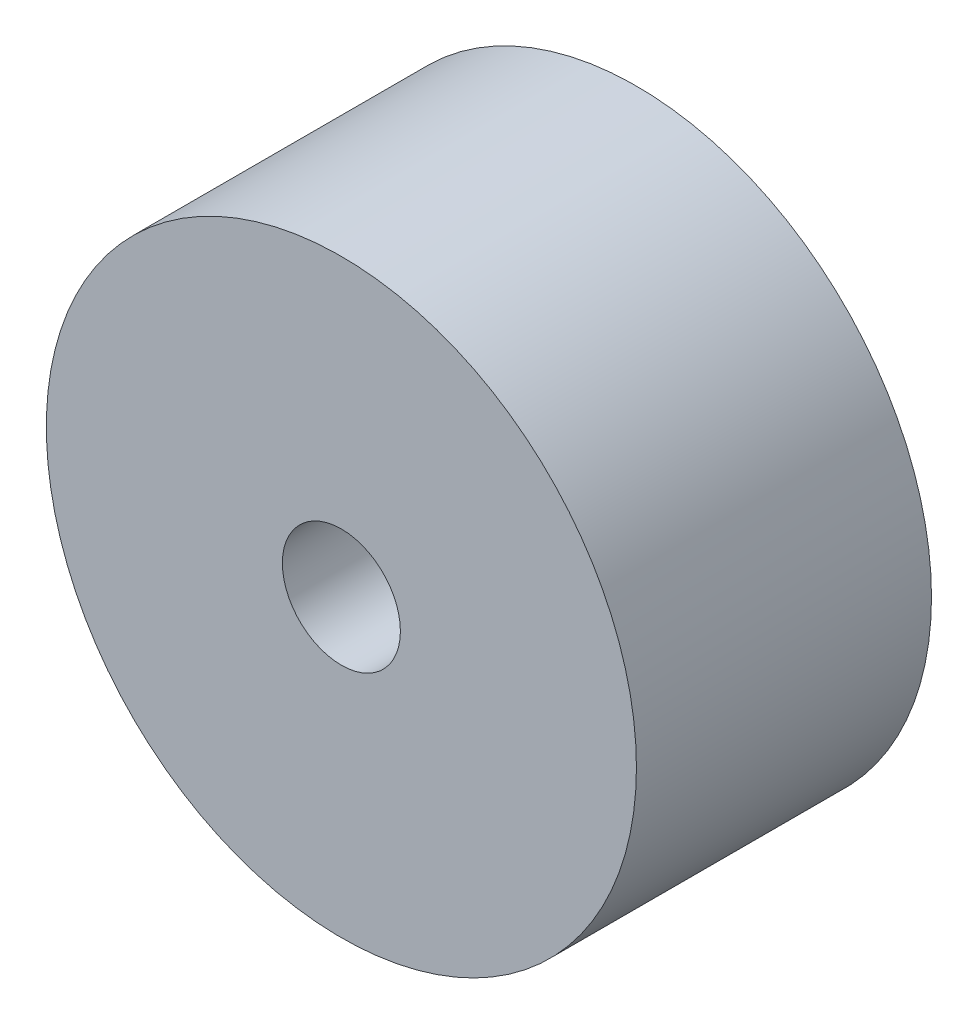
ISO-10303-21;
HEADER;
FILE_DESCRIPTION(('STEP AP214'),'2;1');
FILE_NAME('part.step','',(''),(''),'','','');
FILE_SCHEMA(('AUTOMOTIVE_DESIGN { 1 0 10303 214 1 1 1 1 }'));
ENDSEC;
DATA;
#1=APPLICATION_CONTEXT('core data for automotive mechanical design processes');
#2=APPLICATION_PROTOCOL_DEFINITION('international standard','automotive_design',2000,#1);
#3=PRODUCT_CONTEXT('',#1,'mechanical');
#4=PRODUCT('Part','Part','',(#3));
#5=PRODUCT_RELATED_PRODUCT_CATEGORY('part','',(#4));
#6=PRODUCT_DEFINITION_FORMATION('','',#4);
#7=PRODUCT_DEFINITION_CONTEXT('part definition',#1,'design');
#8=PRODUCT_DEFINITION('design','',#6,#7);
#9=PRODUCT_DEFINITION_SHAPE('','',#8);
#10=(LENGTH_UNIT() NAMED_UNIT(*) SI_UNIT(.MILLI.,.METRE.));
#11=(NAMED_UNIT(*) PLANE_ANGLE_UNIT() SI_UNIT($,.RADIAN.));
#12=(NAMED_UNIT(*) SI_UNIT($,.STERADIAN.) SOLID_ANGLE_UNIT());
#13=UNCERTAINTY_MEASURE_WITH_UNIT(LENGTH_MEASURE(1.E-05),#10,'distance_accuracy_value','');
#14=(GEOMETRIC_REPRESENTATION_CONTEXT(3) GLOBAL_UNCERTAINTY_ASSIGNED_CONTEXT((#13)) GLOBAL_UNIT_ASSIGNED_CONTEXT((#10,
#11,#12)) REPRESENTATION_CONTEXT('',''));
#15=CARTESIAN_POINT('',(0.,0.,0.));
#16=DIRECTION('',(0.,0.,1.));
#17=DIRECTION('',(1.,0.,0.));
#18=AXIS2_PLACEMENT_3D('',#15,#16,#17);
#19=CARTESIAN_POINT('',(0.,0.,0.));
#20=DIRECTION('',(0.,0.,1.));
#21=DIRECTION('',(1.,0.,0.));
#22=AXIS2_PLACEMENT_3D('',#19,#20,#21);
#23=PLANE('',#22);
#24=CARTESIAN_POINT('',(0.,0.,0.));
#25=DIRECTION('',(0.,0.,1.));
#26=DIRECTION('',(1.,0.,0.));
#27=AXIS2_PLACEMENT_3D('',#24,#25,#26);
#28=CIRCLE('',#27,0.5);
#29=CARTESIAN_POINT('',(0.5,0.,0.));
#30=VERTEX_POINT('',#29);
#31=EDGE_CURVE('E49',#30,#30,#28,.T.);
#32=ORIENTED_EDGE('',*,*,#31,.F.);
#33=EDGE_LOOP('',(#32));
#34=FACE_BOUND('',#33,.T.);
#35=CARTESIAN_POINT('',(0.,0.,0.));
#36=DIRECTION('',(0.,0.,-1.));
#37=DIRECTION('',(-1.,0.,0.));
#38=AXIS2_PLACEMENT_3D('',#35,#36,#37);
#39=CIRCLE('',#38,0.279508497187474);
#40=CARTESIAN_POINT('',(-0.279508497187474,0.,0.));
#41=VERTEX_POINT('',#40);
#42=EDGE_CURVE('E57',#41,#41,#39,.T.);
#43=ORIENTED_EDGE('',*,*,#42,.F.);
#44=EDGE_LOOP('',(#43));
#45=FACE_BOUND('',#44,.T.);
#46=ADVANCED_FACE('F34',(#34,#45),#23,.F.);
#47=CARTESIAN_POINT('',(0.,0.,0.5));
#48=DIRECTION('',(0.,0.,-1.));
#49=DIRECTION('',(-1.,0.,0.));
#50=AXIS2_PLACEMENT_3D('',#47,#48,#49);
#51=CYLINDRICAL_SURFACE('',#50,0.1);
#52=CARTESIAN_POINT('',(0.,0.,0.211654632815485));
#53=DIRECTION('',(0.,0.,-1.));
#54=DIRECTION('',(-1.,0.,0.));
#55=AXIS2_PLACEMENT_3D('',#52,#53,#54);
#56=CIRCLE('',#55,0.1);
#57=CARTESIAN_POINT('',(-0.1,0.,0.211654632815485));
#58=VERTEX_POINT('',#57);
#59=EDGE_CURVE('E41',#58,#58,#56,.T.);
#60=ORIENTED_EDGE('',*,*,#59,.T.);
#61=EDGE_LOOP('',(#60));
#62=FACE_BOUND('',#61,.T.);
#63=CARTESIAN_POINT('',(0.,0.,0.5));
#64=DIRECTION('',(0.,0.,1.));
#65=DIRECTION('',(1.,0.,0.));
#66=AXIS2_PLACEMENT_3D('',#63,#64,#65);
#67=CIRCLE('',#66,0.1);
#68=CARTESIAN_POINT('',(0.1,0.,0.5));
#69=VERTEX_POINT('',#68);
#70=EDGE_CURVE('E53',#69,#69,#67,.T.);
#71=ORIENTED_EDGE('',*,*,#70,.T.);
#72=EDGE_LOOP('',(#71));
#73=FACE_BOUND('',#72,.T.);
#74=ADVANCED_FACE('F64',(#62,#73),#51,.F.);
#75=CARTESIAN_POINT('',(0.,0.,0.5));
#76=DIRECTION('',(0.,0.,1.));
#77=DIRECTION('',(1.,0.,0.));
#78=AXIS2_PLACEMENT_3D('',#75,#76,#77);
#79=PLANE('',#78);
#80=CARTESIAN_POINT('',(0.,0.,0.5));
#81=DIRECTION('',(0.,0.,1.));
#82=DIRECTION('',(1.,0.,0.));
#83=AXIS2_PLACEMENT_3D('',#80,#81,#82);
#84=CIRCLE('',#83,0.5);
#85=CARTESIAN_POINT('',(0.5,0.,0.5));
#86=VERTEX_POINT('',#85);
#87=EDGE_CURVE('E45',#86,#86,#84,.T.);
#88=ORIENTED_EDGE('',*,*,#87,.T.);
#89=EDGE_LOOP('',(#88));
#90=FACE_BOUND('',#89,.T.);
#91=ORIENTED_EDGE('',*,*,#70,.F.);
#92=EDGE_LOOP('',(#91));
#93=FACE_BOUND('',#92,.T.);
#94=ADVANCED_FACE('F70',(#90,#93),#79,.T.);
#95=CARTESIAN_POINT('',(0.,0.,0.5));
#96=DIRECTION('',(0.,0.,-1.));
#97=DIRECTION('',(-1.,0.,0.));
#98=AXIS2_PLACEMENT_3D('',#95,#96,#97);
#99=CYLINDRICAL_SURFACE('',#98,0.5);
#100=ORIENTED_EDGE('',*,*,#87,.F.);
#101=EDGE_LOOP('',(#100));
#102=FACE_BOUND('',#101,.T.);
#103=ORIENTED_EDGE('',*,*,#31,.T.);
#104=EDGE_LOOP('',(#103));
#105=FACE_BOUND('',#104,.T.);
#106=ADVANCED_FACE('F74',(#102,#105),#99,.T.);
#107=CARTESIAN_POINT('',(0.,0.,-0.25));
#108=DIRECTION('',(0.,0.,-1.));
#109=DIRECTION('',(0.,-1.,0.));
#110=AXIS2_PLACEMENT_3D('',#107,#108,#109);
#111=SPHERICAL_SURFACE('',#110,0.375);
#112=CARTESIAN_POINT('',(0.,0.,0.0797533091539179));
#113=DIRECTION('',(0.,0.,-1.));
#114=DIRECTION('',(-1.,0.,0.));
#115=AXIS2_PLACEMENT_3D('',#112,#113,#114);
#116=CIRCLE('',#115,0.178571428571429);
#117=CARTESIAN_POINT('',(-0.178571428571429,0.,0.0797533091539179));
#118=VERTEX_POINT('',#117);
#119=EDGE_CURVE('E10',#118,#118,#116,.F.);
#120=ORIENTED_EDGE('',*,*,#119,.T.);
#121=EDGE_LOOP('',(#120));
#122=FACE_BOUND('',#121,.T.);
#123=ORIENTED_EDGE('',*,*,#42,.T.);
#124=EDGE_LOOP('',(#123));
#125=FACE_BOUND('',#124,.T.);
#126=ADVANCED_FACE('F61',(#122,#125),#111,.F.);
#127=CARTESIAN_POINT('',(0.,0.,0.211654632815485));
#128=DIRECTION('',(0.,0.,-1.));
#129=DIRECTION('',(-1.,0.,0.));
#130=AXIS2_PLACEMENT_3D('',#127,#128,#129);
#131=TOROIDAL_SURFACE('',#130,0.25,0.15);
#132=ORIENTED_EDGE('',*,*,#119,.F.);
#133=EDGE_LOOP('',(#132));
#134=FACE_BOUND('',#133,.T.);
#135=ORIENTED_EDGE('',*,*,#59,.F.);
#136=EDGE_LOOP('',(#135));
#137=FACE_BOUND('',#136,.T.);
#138=ADVANCED_FACE('F36',(#134,#137),#131,.T.);
#139=CLOSED_SHELL('',(#46,#74,#94,#106,#126,#138));
#140=MANIFOLD_SOLID_BREP('B2',#139);
#141=ADVANCED_BREP_SHAPE_REPRESENTATION('',(#18,#140),#14);
#142=SHAPE_DEFINITION_REPRESENTATION(#9,#141);
ENDSEC;
END-ISO-10303-21;
